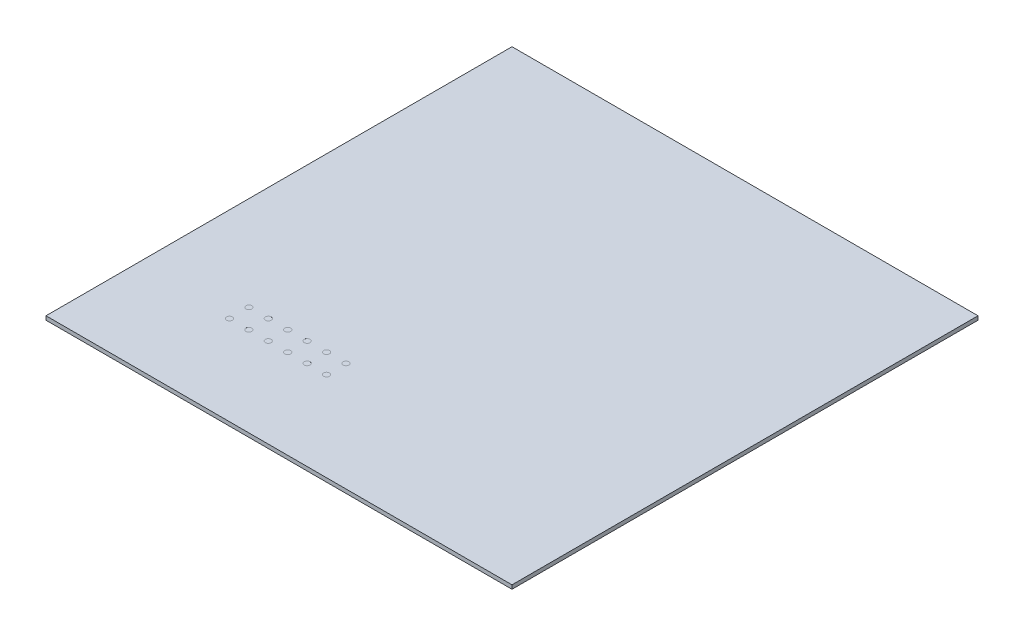
ISO-10303-21;
HEADER;
FILE_DESCRIPTION(('STEP AP214'),'2;1');
FILE_NAME('part.step','',(''),(''),'','','');
FILE_SCHEMA(('AUTOMOTIVE_DESIGN { 1 0 10303 214 1 1 1 1 }'));
ENDSEC;
DATA;
#1=APPLICATION_CONTEXT('core data for automotive mechanical design processes');
#2=APPLICATION_PROTOCOL_DEFINITION('international standard','automotive_design',2000,#1);
#3=PRODUCT_CONTEXT('',#1,'mechanical');
#4=PRODUCT('Part','Part','',(#3));
#5=PRODUCT_RELATED_PRODUCT_CATEGORY('part','',(#4));
#6=PRODUCT_DEFINITION_FORMATION('','',#4);
#7=PRODUCT_DEFINITION_CONTEXT('part definition',#1,'design');
#8=PRODUCT_DEFINITION('design','',#6,#7);
#9=PRODUCT_DEFINITION_SHAPE('','',#8);
#10=(LENGTH_UNIT() NAMED_UNIT(*) SI_UNIT(.MILLI.,.METRE.));
#11=(NAMED_UNIT(*) PLANE_ANGLE_UNIT() SI_UNIT($,.RADIAN.));
#12=(NAMED_UNIT(*) SI_UNIT($,.STERADIAN.) SOLID_ANGLE_UNIT());
#13=UNCERTAINTY_MEASURE_WITH_UNIT(LENGTH_MEASURE(1.E-05),#10,'distance_accuracy_value','');
#14=(GEOMETRIC_REPRESENTATION_CONTEXT(3) GLOBAL_UNCERTAINTY_ASSIGNED_CONTEXT((#13)) GLOBAL_UNIT_ASSIGNED_CONTEXT((#10,
#11,#12)) REPRESENTATION_CONTEXT('',''));
#15=CARTESIAN_POINT('',(0.,0.,0.));
#16=DIRECTION('',(0.,0.,1.));
#17=DIRECTION('',(1.,0.,0.));
#18=AXIS2_PLACEMENT_3D('',#15,#16,#17);
#19=CARTESIAN_POINT('',(0.,100.,0.));
#20=DIRECTION('',(1.,0.,0.));
#21=DIRECTION('',(0.,0.,-1.));
#22=AXIS2_PLACEMENT_3D('',#19,#20,#21);
#23=PLANE('',#22);
#24=DIRECTION('',(0.,0.,1.));
#25=VECTOR('',#24,1.);
#26=CARTESIAN_POINT('',(0.,0.,0.));
#27=LINE('',#26,#25);
#28=CARTESIAN_POINT('',(0.,0.,-12000.));
#29=VERTEX_POINT('',#28);
#30=CARTESIAN_POINT('',(0.,0.,0.));
#31=VERTEX_POINT('',#30);
#32=EDGE_CURVE('E110',#29,#31,#27,.T.);
#33=ORIENTED_EDGE('',*,*,#32,.T.);
#34=DIRECTION('',(0.,-1.,0.));
#35=VECTOR('',#34,1.);
#36=CARTESIAN_POINT('',(0.,100.,0.));
#37=LINE('',#36,#35);
#38=CARTESIAN_POINT('',(0.,100.,0.));
#39=VERTEX_POINT('',#38);
#40=EDGE_CURVE('E11',#39,#31,#37,.T.);
#41=ORIENTED_EDGE('',*,*,#40,.F.);
#42=DIRECTION('',(0.,0.,1.));
#43=VECTOR('',#42,1.);
#44=CARTESIAN_POINT('',(0.,100.,0.));
#45=LINE('',#44,#43);
#46=CARTESIAN_POINT('',(0.,100.,-12000.));
#47=VERTEX_POINT('',#46);
#48=EDGE_CURVE('E94',#47,#39,#45,.T.);
#49=ORIENTED_EDGE('',*,*,#48,.F.);
#50=DIRECTION('',(0.,-1.,0.));
#51=VECTOR('',#50,1.);
#52=CARTESIAN_POINT('',(0.,100.,-12000.));
#53=LINE('',#52,#51);
#54=EDGE_CURVE('E106',#47,#29,#53,.T.);
#55=ORIENTED_EDGE('',*,*,#54,.T.);
#56=EDGE_LOOP('',(#33,#41,#49,#55));
#57=FACE_BOUND('',#56,.T.);
#58=ADVANCED_FACE('F42',(#57),#23,.F.);
#59=CARTESIAN_POINT('',(0.,100.,0.));
#60=DIRECTION('',(0.,0.,-1.));
#61=DIRECTION('',(-1.,0.,0.));
#62=AXIS2_PLACEMENT_3D('',#59,#60,#61);
#63=PLANE('',#62);
#64=DIRECTION('',(1.,0.,0.));
#65=VECTOR('',#64,1.);
#66=CARTESIAN_POINT('',(0.,0.,0.));
#67=LINE('',#66,#65);
#68=CARTESIAN_POINT('',(12000.,0.,0.));
#69=VERTEX_POINT('',#68);
#70=EDGE_CURVE('E99',#31,#69,#67,.T.);
#71=ORIENTED_EDGE('',*,*,#70,.T.);
#72=DIRECTION('',(0.,-1.,0.));
#73=VECTOR('',#72,1.);
#74=CARTESIAN_POINT('',(12000.,100.,0.));
#75=LINE('',#74,#73);
#76=CARTESIAN_POINT('',(12000.,100.,0.));
#77=VERTEX_POINT('',#76);
#78=EDGE_CURVE('E51',#77,#69,#75,.T.);
#79=ORIENTED_EDGE('',*,*,#78,.F.);
#80=DIRECTION('',(1.,0.,0.));
#81=VECTOR('',#80,1.);
#82=CARTESIAN_POINT('',(0.,100.,0.));
#83=LINE('',#82,#81);
#84=EDGE_CURVE('E89',#39,#77,#83,.T.);
#85=ORIENTED_EDGE('',*,*,#84,.F.);
#86=ORIENTED_EDGE('',*,*,#40,.T.);
#87=EDGE_LOOP('',(#71,#79,#85,#86));
#88=FACE_BOUND('',#87,.T.);
#89=ADVANCED_FACE('F98',(#88),#63,.F.);
#90=CARTESIAN_POINT('',(12000.,100.,0.));
#91=DIRECTION('',(-1.,0.,0.));
#92=DIRECTION('',(0.,0.,1.));
#93=AXIS2_PLACEMENT_3D('',#90,#91,#92);
#94=PLANE('',#93);
#95=DIRECTION('',(0.,0.,-1.));
#96=VECTOR('',#95,1.);
#97=CARTESIAN_POINT('',(12000.,0.,0.));
#98=LINE('',#97,#96);
#99=CARTESIAN_POINT('',(12000.,0.,-12000.));
#100=VERTEX_POINT('',#99);
#101=EDGE_CURVE('E76',#69,#100,#98,.T.);
#102=ORIENTED_EDGE('',*,*,#101,.T.);
#103=DIRECTION('',(0.,-1.,0.));
#104=VECTOR('',#103,1.);
#105=CARTESIAN_POINT('',(12000.,100.,-12000.));
#106=LINE('',#105,#104);
#107=CARTESIAN_POINT('',(12000.,100.,-12000.));
#108=VERTEX_POINT('',#107);
#109=EDGE_CURVE('E101',#108,#100,#106,.T.);
#110=ORIENTED_EDGE('',*,*,#109,.F.);
#111=DIRECTION('',(0.,0.,-1.));
#112=VECTOR('',#111,1.);
#113=CARTESIAN_POINT('',(12000.,100.,0.));
#114=LINE('',#113,#112);
#115=EDGE_CURVE('E92',#77,#108,#114,.T.);
#116=ORIENTED_EDGE('',*,*,#115,.F.);
#117=ORIENTED_EDGE('',*,*,#78,.T.);
#118=EDGE_LOOP('',(#102,#110,#116,#117));
#119=FACE_BOUND('',#118,.T.);
#120=ADVANCED_FACE('F102',(#119),#94,.F.);
#121=CARTESIAN_POINT('',(0.,100.,-12000.));
#122=DIRECTION('',(0.,0.,1.));
#123=DIRECTION('',(1.,0.,0.));
#124=AXIS2_PLACEMENT_3D('',#121,#122,#123);
#125=PLANE('',#124);
#126=DIRECTION('',(-1.,0.,0.));
#127=VECTOR('',#126,1.);
#128=CARTESIAN_POINT('',(0.,0.,-12000.));
#129=LINE('',#128,#127);
#130=EDGE_CURVE('E82',#100,#29,#129,.T.);
#131=ORIENTED_EDGE('',*,*,#130,.T.);
#132=ORIENTED_EDGE('',*,*,#54,.F.);
#133=DIRECTION('',(-1.,0.,0.));
#134=VECTOR('',#133,1.);
#135=CARTESIAN_POINT('',(0.,100.,-12000.));
#136=LINE('',#135,#134);
#137=EDGE_CURVE('E59',#108,#47,#136,.T.);
#138=ORIENTED_EDGE('',*,*,#137,.F.);
#139=ORIENTED_EDGE('',*,*,#109,.T.);
#140=EDGE_LOOP('',(#131,#132,#138,#139));
#141=FACE_BOUND('',#140,.T.);
#142=ADVANCED_FACE('F124',(#141),#125,.F.);
#143=CARTESIAN_POINT('',(0.,100.,0.));
#144=DIRECTION('',(0.,-1.,0.));
#145=DIRECTION('',(0.,0.,-1.));
#146=AXIS2_PLACEMENT_3D('',#143,#144,#145);
#147=PLANE('',#146);
#148=CARTESIAN_POINT('',(3425.,100.,-2800.));
#149=DIRECTION('',(0.,1.,0.));
#150=DIRECTION('',(0.,0.,1.));
#151=AXIS2_PLACEMENT_3D('',#148,#149,#150);
#152=CIRCLE('',#151,75.);
#153=CARTESIAN_POINT('',(3425.,100.,-2725.));
#154=VERTEX_POINT('',#153);
#155=EDGE_CURVE('E175',#154,#154,#152,.T.);
#156=ORIENTED_EDGE('',*,*,#155,.F.);
#157=EDGE_LOOP('',(#156));
#158=FACE_BOUND('',#157,.T.);
#159=CARTESIAN_POINT('',(2925.,100.,-2800.));
#160=DIRECTION('',(0.,1.,0.));
#161=DIRECTION('',(0.,0.,1.));
#162=AXIS2_PLACEMENT_3D('',#159,#160,#161);
#163=CIRCLE('',#162,75.);
#164=CARTESIAN_POINT('',(2925.,100.,-2725.));
#165=VERTEX_POINT('',#164);
#166=EDGE_CURVE('E184',#165,#165,#163,.T.);
#167=ORIENTED_EDGE('',*,*,#166,.F.);
#168=EDGE_LOOP('',(#167));
#169=FACE_BOUND('',#168,.T.);
#170=CARTESIAN_POINT('',(4925.,100.,-2300.));
#171=DIRECTION('',(0.,1.,0.));
#172=DIRECTION('',(0.,0.,1.));
#173=AXIS2_PLACEMENT_3D('',#170,#171,#172);
#174=CIRCLE('',#173,74.9999999999995);
#175=CARTESIAN_POINT('',(4925.,100.,-2225.));
#176=VERTEX_POINT('',#175);
#177=EDGE_CURVE('E192',#176,#176,#174,.T.);
#178=ORIENTED_EDGE('',*,*,#177,.F.);
#179=EDGE_LOOP('',(#178));
#180=FACE_BOUND('',#179,.T.);
#181=CARTESIAN_POINT('',(4425.,100.,-2300.));
#182=DIRECTION('',(0.,1.,0.));
#183=DIRECTION('',(0.,0.,1.));
#184=AXIS2_PLACEMENT_3D('',#181,#182,#183);
#185=CIRCLE('',#184,74.9999999999995);
#186=CARTESIAN_POINT('',(4425.,100.,-2225.));
#187=VERTEX_POINT('',#186);
#188=EDGE_CURVE('E144',#187,#187,#185,.T.);
#189=ORIENTED_EDGE('',*,*,#188,.F.);
#190=EDGE_LOOP('',(#189));
#191=FACE_BOUND('',#190,.T.);
#192=CARTESIAN_POINT('',(3925.,100.,-2300.));
#193=DIRECTION('',(0.,1.,0.));
#194=DIRECTION('',(0.,0.,1.));
#195=AXIS2_PLACEMENT_3D('',#192,#193,#194);
#196=CIRCLE('',#195,75.);
#197=CARTESIAN_POINT('',(3925.,100.,-2225.));
#198=VERTEX_POINT('',#197);
#199=EDGE_CURVE('E143',#198,#198,#196,.T.);
#200=ORIENTED_EDGE('',*,*,#199,.F.);
#201=EDGE_LOOP('',(#200));
#202=FACE_BOUND('',#201,.T.);
#203=CARTESIAN_POINT('',(3425.,100.,-2300.));
#204=DIRECTION('',(0.,1.,0.));
#205=DIRECTION('',(0.,0.,1.));
#206=AXIS2_PLACEMENT_3D('',#203,#204,#205);
#207=CIRCLE('',#206,75.);
#208=CARTESIAN_POINT('',(3425.,100.,-2225.));
#209=VERTEX_POINT('',#208);
#210=EDGE_CURVE('E152',#209,#209,#207,.T.);
#211=ORIENTED_EDGE('',*,*,#210,.F.);
#212=EDGE_LOOP('',(#211));
#213=FACE_BOUND('',#212,.T.);
#214=CARTESIAN_POINT('',(2925.,100.,-2300.));
#215=DIRECTION('',(0.,1.,0.));
#216=DIRECTION('',(0.,0.,1.));
#217=AXIS2_PLACEMENT_3D('',#214,#215,#216);
#218=CIRCLE('',#217,75.);
#219=CARTESIAN_POINT('',(2925.,100.,-2225.));
#220=VERTEX_POINT('',#219);
#221=EDGE_CURVE('E160',#220,#220,#218,.T.);
#222=ORIENTED_EDGE('',*,*,#221,.F.);
#223=EDGE_LOOP('',(#222));
#224=FACE_BOUND('',#223,.T.);
#225=CARTESIAN_POINT('',(2425.,100.,-2300.));
#226=DIRECTION('',(0.,1.,0.));
#227=DIRECTION('',(0.,0.,1.));
#228=AXIS2_PLACEMENT_3D('',#225,#226,#227);
#229=CIRCLE('',#228,75.);
#230=CARTESIAN_POINT('',(2425.,100.,-2225.));
#231=VERTEX_POINT('',#230);
#232=EDGE_CURVE('E135',#231,#231,#229,.T.);
#233=ORIENTED_EDGE('',*,*,#232,.F.);
#234=EDGE_LOOP('',(#233));
#235=FACE_BOUND('',#234,.T.);
#236=CARTESIAN_POINT('',(3925.,100.,-2800.));
#237=DIRECTION('',(0.,1.,0.));
#238=DIRECTION('',(0.,0.,1.));
#239=AXIS2_PLACEMENT_3D('',#236,#237,#238);
#240=CIRCLE('',#239,75.);
#241=CARTESIAN_POINT('',(3925.,100.,-2725.));
#242=VERTEX_POINT('',#241);
#243=EDGE_CURVE('E176',#242,#242,#240,.T.);
#244=ORIENTED_EDGE('',*,*,#243,.F.);
#245=EDGE_LOOP('',(#244));
#246=FACE_BOUND('',#245,.T.);
#247=CARTESIAN_POINT('',(4425.,100.,-2800.));
#248=DIRECTION('',(0.,1.,0.));
#249=DIRECTION('',(0.,0.,1.));
#250=AXIS2_PLACEMENT_3D('',#247,#248,#249);
#251=CIRCLE('',#250,74.9999999999995);
#252=CARTESIAN_POINT('',(4425.,100.,-2725.));
#253=VERTEX_POINT('',#252);
#254=EDGE_CURVE('E215',#253,#253,#251,.T.);
#255=ORIENTED_EDGE('',*,*,#254,.F.);
#256=EDGE_LOOP('',(#255));
#257=FACE_BOUND('',#256,.T.);
#258=CARTESIAN_POINT('',(4925.,100.,-2800.));
#259=DIRECTION('',(0.,1.,0.));
#260=DIRECTION('',(0.,0.,1.));
#261=AXIS2_PLACEMENT_3D('',#258,#259,#260);
#262=CIRCLE('',#261,74.9999999999995);
#263=CARTESIAN_POINT('',(4925.,100.,-2725.));
#264=VERTEX_POINT('',#263);
#265=EDGE_CURVE('E207',#264,#264,#262,.T.);
#266=ORIENTED_EDGE('',*,*,#265,.F.);
#267=EDGE_LOOP('',(#266));
#268=FACE_BOUND('',#267,.T.);
#269=CARTESIAN_POINT('',(2425.,100.,-2800.));
#270=DIRECTION('',(0.,1.,0.));
#271=DIRECTION('',(0.,0.,1.));
#272=AXIS2_PLACEMENT_3D('',#269,#270,#271);
#273=CIRCLE('',#272,75.);
#274=CARTESIAN_POINT('',(2425.,100.,-2725.));
#275=VERTEX_POINT('',#274);
#276=EDGE_CURVE('E131',#275,#275,#273,.T.);
#277=ORIENTED_EDGE('',*,*,#276,.F.);
#278=EDGE_LOOP('',(#277));
#279=FACE_BOUND('',#278,.T.);
#280=ORIENTED_EDGE('',*,*,#48,.T.);
#281=ORIENTED_EDGE('',*,*,#84,.T.);
#282=ORIENTED_EDGE('',*,*,#115,.T.);
#283=ORIENTED_EDGE('',*,*,#137,.T.);
#284=EDGE_LOOP('',(#280,#281,#282,#283));
#285=FACE_BOUND('',#284,.T.);
#286=ADVANCED_FACE('F90',(#158,#169,#180,#191,#202,#213,#224,#235,#246,#257,#268,#279,#285),
#147,.F.);
#287=CARTESIAN_POINT('',(0.,0.,0.));
#288=DIRECTION('',(0.,-1.,0.));
#289=DIRECTION('',(0.,0.,-1.));
#290=AXIS2_PLACEMENT_3D('',#287,#288,#289);
#291=PLANE('',#290);
#292=ORIENTED_EDGE('',*,*,#32,.F.);
#293=ORIENTED_EDGE('',*,*,#130,.F.);
#294=ORIENTED_EDGE('',*,*,#101,.F.);
#295=ORIENTED_EDGE('',*,*,#70,.F.);
#296=EDGE_LOOP('',(#292,#293,#294,#295));
#297=FACE_BOUND('',#296,.T.);
#298=ADVANCED_FACE('F127',(#297),#291,.T.);
#299=CARTESIAN_POINT('',(2425.,99.9,-2800.));
#300=DIRECTION('',(0.,1.,0.));
#301=DIRECTION('',(0.,0.,1.));
#302=AXIS2_PLACEMENT_3D('',#299,#300,#301);
#303=CYLINDRICAL_SURFACE('',#302,75.);
#304=CARTESIAN_POINT('',(2425.,99.9,-2800.));
#305=DIRECTION('',(0.,1.,0.));
#306=DIRECTION('',(0.,0.,1.));
#307=AXIS2_PLACEMENT_3D('',#304,#305,#306);
#308=CIRCLE('',#307,75.);
#309=CARTESIAN_POINT('',(2425.,99.9,-2725.));
#310=VERTEX_POINT('',#309);
#311=EDGE_CURVE('E114',#310,#310,#308,.T.);
#312=ORIENTED_EDGE('',*,*,#311,.F.);
#313=EDGE_LOOP('',(#312));
#314=FACE_BOUND('',#313,.T.);
#315=ORIENTED_EDGE('',*,*,#276,.T.);
#316=EDGE_LOOP('',(#315));
#317=FACE_BOUND('',#316,.T.);
#318=ADVANCED_FACE('F239',(#314,#317),#303,.F.);
#319=CARTESIAN_POINT('',(2425.,99.9,-2800.));
#320=DIRECTION('',(0.,1.,0.));
#321=DIRECTION('',(0.,0.,1.));
#322=AXIS2_PLACEMENT_3D('',#319,#320,#321);
#323=PLANE('',#322);
#324=ORIENTED_EDGE('',*,*,#311,.T.);
#325=EDGE_LOOP('',(#324));
#326=FACE_BOUND('',#325,.T.);
#327=ADVANCED_FACE('F241',(#326),#323,.T.);
#328=CARTESIAN_POINT('',(4925.,99.9,-2800.));
#329=DIRECTION('',(0.,1.,0.));
#330=DIRECTION('',(0.,0.,1.));
#331=AXIS2_PLACEMENT_3D('',#328,#329,#330);
#332=CYLINDRICAL_SURFACE('',#331,74.9999999999995);
#333=CARTESIAN_POINT('',(4925.,99.9,-2800.));
#334=DIRECTION('',(0.,1.,0.));
#335=DIRECTION('',(0.,0.,1.));
#336=AXIS2_PLACEMENT_3D('',#333,#334,#335);
#337=CIRCLE('',#336,74.9999999999995);
#338=CARTESIAN_POINT('',(4925.,99.9,-2725.));
#339=VERTEX_POINT('',#338);
#340=EDGE_CURVE('E203',#339,#339,#337,.T.);
#341=ORIENTED_EDGE('',*,*,#340,.F.);
#342=EDGE_LOOP('',(#341));
#343=FACE_BOUND('',#342,.T.);
#344=ORIENTED_EDGE('',*,*,#265,.T.);
#345=EDGE_LOOP('',(#344));
#346=FACE_BOUND('',#345,.T.);
#347=ADVANCED_FACE('F248',(#343,#346),#332,.F.);
#348=CARTESIAN_POINT('',(4925.,99.9,-2800.));
#349=DIRECTION('',(0.,1.,0.));
#350=DIRECTION('',(0.,0.,1.));
#351=AXIS2_PLACEMENT_3D('',#348,#349,#350);
#352=PLANE('',#351);
#353=ORIENTED_EDGE('',*,*,#340,.T.);
#354=EDGE_LOOP('',(#353));
#355=FACE_BOUND('',#354,.T.);
#356=ADVANCED_FACE('F304',(#355),#352,.T.);
#357=CARTESIAN_POINT('',(4425.,99.9,-2800.));
#358=DIRECTION('',(0.,1.,0.));
#359=DIRECTION('',(0.,0.,1.));
#360=AXIS2_PLACEMENT_3D('',#357,#358,#359);
#361=CYLINDRICAL_SURFACE('',#360,74.9999999999995);
#362=CARTESIAN_POINT('',(4425.,99.9,-2800.));
#363=DIRECTION('',(0.,1.,0.));
#364=DIRECTION('',(0.,0.,1.));
#365=AXIS2_PLACEMENT_3D('',#362,#363,#364);
#366=CIRCLE('',#365,74.9999999999995);
#367=CARTESIAN_POINT('',(4425.,99.9,-2725.));
#368=VERTEX_POINT('',#367);
#369=EDGE_CURVE('E211',#368,#368,#366,.T.);
#370=ORIENTED_EDGE('',*,*,#369,.F.);
#371=EDGE_LOOP('',(#370));
#372=FACE_BOUND('',#371,.T.);
#373=ORIENTED_EDGE('',*,*,#254,.T.);
#374=EDGE_LOOP('',(#373));
#375=FACE_BOUND('',#374,.T.);
#376=ADVANCED_FACE('F315',(#372,#375),#361,.F.);
#377=CARTESIAN_POINT('',(4425.,99.9,-2800.));
#378=DIRECTION('',(0.,1.,0.));
#379=DIRECTION('',(0.,0.,1.));
#380=AXIS2_PLACEMENT_3D('',#377,#378,#379);
#381=PLANE('',#380);
#382=ORIENTED_EDGE('',*,*,#369,.T.);
#383=EDGE_LOOP('',(#382));
#384=FACE_BOUND('',#383,.T.);
#385=ADVANCED_FACE('F326',(#384),#381,.T.);
#386=CARTESIAN_POINT('',(3925.,99.9,-2800.));
#387=DIRECTION('',(0.,1.,0.));
#388=DIRECTION('',(0.,0.,1.));
#389=AXIS2_PLACEMENT_3D('',#386,#387,#388);
#390=CYLINDRICAL_SURFACE('',#389,75.);
#391=CARTESIAN_POINT('',(3925.,99.9,-2800.));
#392=DIRECTION('',(0.,1.,0.));
#393=DIRECTION('',(0.,0.,1.));
#394=AXIS2_PLACEMENT_3D('',#391,#392,#393);
#395=CIRCLE('',#394,75.);
#396=CARTESIAN_POINT('',(3925.,99.9,-2725.));
#397=VERTEX_POINT('',#396);
#398=EDGE_CURVE('E219',#397,#397,#395,.T.);
#399=ORIENTED_EDGE('',*,*,#398,.F.);
#400=EDGE_LOOP('',(#399));
#401=FACE_BOUND('',#400,.T.);
#402=ORIENTED_EDGE('',*,*,#243,.T.);
#403=EDGE_LOOP('',(#402));
#404=FACE_BOUND('',#403,.T.);
#405=ADVANCED_FACE('F227',(#401,#404),#390,.F.);
#406=CARTESIAN_POINT('',(3925.,99.9,-2800.));
#407=DIRECTION('',(0.,1.,0.));
#408=DIRECTION('',(0.,0.,1.));
#409=AXIS2_PLACEMENT_3D('',#406,#407,#408);
#410=PLANE('',#409);
#411=ORIENTED_EDGE('',*,*,#398,.T.);
#412=EDGE_LOOP('',(#411));
#413=FACE_BOUND('',#412,.T.);
#414=ADVANCED_FACE('F347',(#413),#410,.T.);
#415=CARTESIAN_POINT('',(2425.,99.9,-2300.));
#416=DIRECTION('',(0.,1.,0.));
#417=DIRECTION('',(0.,0.,1.));
#418=AXIS2_PLACEMENT_3D('',#415,#416,#417);
#419=CYLINDRICAL_SURFACE('',#418,75.);
#420=CARTESIAN_POINT('',(2425.,99.9,-2300.));
#421=DIRECTION('',(0.,1.,0.));
#422=DIRECTION('',(0.,0.,1.));
#423=AXIS2_PLACEMENT_3D('',#420,#421,#422);
#424=CIRCLE('',#423,75.);
#425=CARTESIAN_POINT('',(2425.,99.9,-2225.));
#426=VERTEX_POINT('',#425);
#427=EDGE_CURVE('E164',#426,#426,#424,.T.);
#428=ORIENTED_EDGE('',*,*,#427,.F.);
#429=EDGE_LOOP('',(#428));
#430=FACE_BOUND('',#429,.T.);
#431=ORIENTED_EDGE('',*,*,#232,.T.);
#432=EDGE_LOOP('',(#431));
#433=FACE_BOUND('',#432,.T.);
#434=ADVANCED_FACE('F358',(#430,#433),#419,.F.);
#435=CARTESIAN_POINT('',(2425.,99.9,-2300.));
#436=DIRECTION('',(0.,1.,0.));
#437=DIRECTION('',(0.,0.,1.));
#438=AXIS2_PLACEMENT_3D('',#435,#436,#437);
#439=PLANE('',#438);
#440=ORIENTED_EDGE('',*,*,#427,.T.);
#441=EDGE_LOOP('',(#440));
#442=FACE_BOUND('',#441,.T.);
#443=ADVANCED_FACE('F369',(#442),#439,.T.);
#444=CARTESIAN_POINT('',(2925.,99.9,-2300.));
#445=DIRECTION('',(0.,1.,0.));
#446=DIRECTION('',(0.,0.,1.));
#447=AXIS2_PLACEMENT_3D('',#444,#445,#446);
#448=CYLINDRICAL_SURFACE('',#447,75.);
#449=CARTESIAN_POINT('',(2925.,99.9,-2300.));
#450=DIRECTION('',(0.,1.,0.));
#451=DIRECTION('',(0.,0.,1.));
#452=AXIS2_PLACEMENT_3D('',#449,#450,#451);
#453=CIRCLE('',#452,75.);
#454=CARTESIAN_POINT('',(2925.,99.9,-2225.));
#455=VERTEX_POINT('',#454);
#456=EDGE_CURVE('E156',#455,#455,#453,.T.);
#457=ORIENTED_EDGE('',*,*,#456,.F.);
#458=EDGE_LOOP('',(#457));
#459=FACE_BOUND('',#458,.T.);
#460=ORIENTED_EDGE('',*,*,#221,.T.);
#461=EDGE_LOOP('',(#460));
#462=FACE_BOUND('',#461,.T.);
#463=ADVANCED_FACE('F380',(#459,#462),#448,.F.);
#464=CARTESIAN_POINT('',(2925.,99.9,-2300.));
#465=DIRECTION('',(0.,1.,0.));
#466=DIRECTION('',(0.,0.,1.));
#467=AXIS2_PLACEMENT_3D('',#464,#465,#466);
#468=PLANE('',#467);
#469=ORIENTED_EDGE('',*,*,#456,.T.);
#470=EDGE_LOOP('',(#469));
#471=FACE_BOUND('',#470,.T.);
#472=ADVANCED_FACE('F391',(#471),#468,.T.);
#473=CARTESIAN_POINT('',(3425.,99.9,-2300.));
#474=DIRECTION('',(0.,1.,0.));
#475=DIRECTION('',(0.,0.,1.));
#476=AXIS2_PLACEMENT_3D('',#473,#474,#475);
#477=CYLINDRICAL_SURFACE('',#476,75.);
#478=CARTESIAN_POINT('',(3425.,99.9,-2300.));
#479=DIRECTION('',(0.,1.,0.));
#480=DIRECTION('',(0.,0.,1.));
#481=AXIS2_PLACEMENT_3D('',#478,#479,#480);
#482=CIRCLE('',#481,75.);
#483=CARTESIAN_POINT('',(3425.,99.9,-2225.));
#484=VERTEX_POINT('',#483);
#485=EDGE_CURVE('E148',#484,#484,#482,.T.);
#486=ORIENTED_EDGE('',*,*,#485,.F.);
#487=EDGE_LOOP('',(#486));
#488=FACE_BOUND('',#487,.T.);
#489=ORIENTED_EDGE('',*,*,#210,.T.);
#490=EDGE_LOOP('',(#489));
#491=FACE_BOUND('',#490,.T.);
#492=ADVANCED_FACE('F402',(#488,#491),#477,.F.);
#493=CARTESIAN_POINT('',(3425.,99.9,-2300.));
#494=DIRECTION('',(0.,1.,0.));
#495=DIRECTION('',(0.,0.,1.));
#496=AXIS2_PLACEMENT_3D('',#493,#494,#495);
#497=PLANE('',#496);
#498=ORIENTED_EDGE('',*,*,#485,.T.);
#499=EDGE_LOOP('',(#498));
#500=FACE_BOUND('',#499,.T.);
#501=ADVANCED_FACE('F413',(#500),#497,.T.);
#502=CARTESIAN_POINT('',(3925.,99.9,-2300.));
#503=DIRECTION('',(0.,1.,0.));
#504=DIRECTION('',(0.,0.,1.));
#505=AXIS2_PLACEMENT_3D('',#502,#503,#504);
#506=CYLINDRICAL_SURFACE('',#505,75.);
#507=CARTESIAN_POINT('',(3925.,99.9,-2300.));
#508=DIRECTION('',(0.,1.,0.));
#509=DIRECTION('',(0.,0.,1.));
#510=AXIS2_PLACEMENT_3D('',#507,#508,#509);
#511=CIRCLE('',#510,75.);
#512=CARTESIAN_POINT('',(3925.,99.9,-2225.));
#513=VERTEX_POINT('',#512);
#514=EDGE_CURVE('E139',#513,#513,#511,.T.);
#515=ORIENTED_EDGE('',*,*,#514,.F.);
#516=EDGE_LOOP('',(#515));
#517=FACE_BOUND('',#516,.T.);
#518=ORIENTED_EDGE('',*,*,#199,.T.);
#519=EDGE_LOOP('',(#518));
#520=FACE_BOUND('',#519,.T.);
#521=ADVANCED_FACE('F424',(#517,#520),#506,.F.);
#522=CARTESIAN_POINT('',(3925.,99.9,-2300.));
#523=DIRECTION('',(0.,1.,0.));
#524=DIRECTION('',(0.,0.,1.));
#525=AXIS2_PLACEMENT_3D('',#522,#523,#524);
#526=PLANE('',#525);
#527=ORIENTED_EDGE('',*,*,#514,.T.);
#528=EDGE_LOOP('',(#527));
#529=FACE_BOUND('',#528,.T.);
#530=ADVANCED_FACE('F435',(#529),#526,.T.);
#531=CARTESIAN_POINT('',(4425.,99.9,-2300.));
#532=DIRECTION('',(0.,1.,0.));
#533=DIRECTION('',(0.,0.,1.));
#534=AXIS2_PLACEMENT_3D('',#531,#532,#533);
#535=CYLINDRICAL_SURFACE('',#534,74.9999999999995);
#536=CARTESIAN_POINT('',(4425.,99.9,-2300.));
#537=DIRECTION('',(0.,1.,0.));
#538=DIRECTION('',(0.,0.,1.));
#539=AXIS2_PLACEMENT_3D('',#536,#537,#538);
#540=CIRCLE('',#539,74.9999999999995);
#541=CARTESIAN_POINT('',(4425.,99.9,-2225.));
#542=VERTEX_POINT('',#541);
#543=EDGE_CURVE('E196',#542,#542,#540,.T.);
#544=ORIENTED_EDGE('',*,*,#543,.F.);
#545=EDGE_LOOP('',(#544));
#546=FACE_BOUND('',#545,.T.);
#547=ORIENTED_EDGE('',*,*,#188,.T.);
#548=EDGE_LOOP('',(#547));
#549=FACE_BOUND('',#548,.T.);
#550=ADVANCED_FACE('F446',(#546,#549),#535,.F.);
#551=CARTESIAN_POINT('',(4425.,99.9,-2300.));
#552=DIRECTION('',(0.,1.,0.));
#553=DIRECTION('',(0.,0.,1.));
#554=AXIS2_PLACEMENT_3D('',#551,#552,#553);
#555=PLANE('',#554);
#556=ORIENTED_EDGE('',*,*,#543,.T.);
#557=EDGE_LOOP('',(#556));
#558=FACE_BOUND('',#557,.T.);
#559=ADVANCED_FACE('F457',(#558),#555,.T.);
#560=CARTESIAN_POINT('',(4925.,99.9,-2300.));
#561=DIRECTION('',(0.,1.,0.));
#562=DIRECTION('',(0.,0.,1.));
#563=AXIS2_PLACEMENT_3D('',#560,#561,#562);
#564=CYLINDRICAL_SURFACE('',#563,74.9999999999995);
#565=CARTESIAN_POINT('',(4925.,99.9,-2300.));
#566=DIRECTION('',(0.,1.,0.));
#567=DIRECTION('',(0.,0.,1.));
#568=AXIS2_PLACEMENT_3D('',#565,#566,#567);
#569=CIRCLE('',#568,74.9999999999995);
#570=CARTESIAN_POINT('',(4925.,99.9,-2225.));
#571=VERTEX_POINT('',#570);
#572=EDGE_CURVE('E188',#571,#571,#569,.T.);
#573=ORIENTED_EDGE('',*,*,#572,.F.);
#574=EDGE_LOOP('',(#573));
#575=FACE_BOUND('',#574,.T.);
#576=ORIENTED_EDGE('',*,*,#177,.T.);
#577=EDGE_LOOP('',(#576));
#578=FACE_BOUND('',#577,.T.);
#579=ADVANCED_FACE('F468',(#575,#578),#564,.F.);
#580=CARTESIAN_POINT('',(4925.,99.9,-2300.));
#581=DIRECTION('',(0.,1.,0.));
#582=DIRECTION('',(0.,0.,1.));
#583=AXIS2_PLACEMENT_3D('',#580,#581,#582);
#584=PLANE('',#583);
#585=ORIENTED_EDGE('',*,*,#572,.T.);
#586=EDGE_LOOP('',(#585));
#587=FACE_BOUND('',#586,.T.);
#588=ADVANCED_FACE('F479',(#587),#584,.T.);
#589=CARTESIAN_POINT('',(2925.,99.9,-2800.));
#590=DIRECTION('',(0.,1.,0.));
#591=DIRECTION('',(0.,0.,1.));
#592=AXIS2_PLACEMENT_3D('',#589,#590,#591);
#593=CYLINDRICAL_SURFACE('',#592,75.);
#594=CARTESIAN_POINT('',(2925.,99.9,-2800.));
#595=DIRECTION('',(0.,1.,0.));
#596=DIRECTION('',(0.,0.,1.));
#597=AXIS2_PLACEMENT_3D('',#594,#595,#596);
#598=CIRCLE('',#597,75.);
#599=CARTESIAN_POINT('',(2925.,99.9,-2725.));
#600=VERTEX_POINT('',#599);
#601=EDGE_CURVE('E180',#600,#600,#598,.T.);
#602=ORIENTED_EDGE('',*,*,#601,.F.);
#603=EDGE_LOOP('',(#602));
#604=FACE_BOUND('',#603,.T.);
#605=ORIENTED_EDGE('',*,*,#166,.T.);
#606=EDGE_LOOP('',(#605));
#607=FACE_BOUND('',#606,.T.);
#608=ADVANCED_FACE('F490',(#604,#607),#593,.F.);
#609=CARTESIAN_POINT('',(2925.,99.9,-2800.));
#610=DIRECTION('',(0.,1.,0.));
#611=DIRECTION('',(0.,0.,1.));
#612=AXIS2_PLACEMENT_3D('',#609,#610,#611);
#613=PLANE('',#612);
#614=ORIENTED_EDGE('',*,*,#601,.T.);
#615=EDGE_LOOP('',(#614));
#616=FACE_BOUND('',#615,.T.);
#617=ADVANCED_FACE('F501',(#616),#613,.T.);
#618=CARTESIAN_POINT('',(3425.,99.9,-2800.));
#619=DIRECTION('',(0.,1.,0.));
#620=DIRECTION('',(0.,0.,1.));
#621=AXIS2_PLACEMENT_3D('',#618,#619,#620);
#622=CYLINDRICAL_SURFACE('',#621,75.);
#623=CARTESIAN_POINT('',(3425.,99.9,-2800.));
#624=DIRECTION('',(0.,1.,0.));
#625=DIRECTION('',(0.,0.,1.));
#626=AXIS2_PLACEMENT_3D('',#623,#624,#625);
#627=CIRCLE('',#626,75.);
#628=CARTESIAN_POINT('',(3425.,99.9,-2725.));
#629=VERTEX_POINT('',#628);
#630=EDGE_CURVE('E171',#629,#629,#627,.T.);
#631=ORIENTED_EDGE('',*,*,#630,.F.);
#632=EDGE_LOOP('',(#631));
#633=FACE_BOUND('',#632,.T.);
#634=ORIENTED_EDGE('',*,*,#155,.T.);
#635=EDGE_LOOP('',(#634));
#636=FACE_BOUND('',#635,.T.);
#637=ADVANCED_FACE('F512',(#633,#636),#622,.F.);
#638=CARTESIAN_POINT('',(3425.,99.9,-2800.));
#639=DIRECTION('',(0.,1.,0.));
#640=DIRECTION('',(0.,0.,1.));
#641=AXIS2_PLACEMENT_3D('',#638,#639,#640);
#642=PLANE('',#641);
#643=ORIENTED_EDGE('',*,*,#630,.T.);
#644=EDGE_LOOP('',(#643));
#645=FACE_BOUND('',#644,.T.);
#646=ADVANCED_FACE('F523',(#645),#642,.T.);
#647=CLOSED_SHELL('',(#58,#89,#120,#142,#286,#298,#318,#327,#347,#356,#376,#385,#405,#414,#434,
#443,#463,#472,#492,#501,#521,#530,#550,#559,#579,#588,#608,#617,#637,#646));
#648=MANIFOLD_SOLID_BREP('B2',#647);
#649=ADVANCED_BREP_SHAPE_REPRESENTATION('',(#18,#648),#14);
#650=SHAPE_DEFINITION_REPRESENTATION(#9,#649);
ENDSEC;
END-ISO-10303-21;
